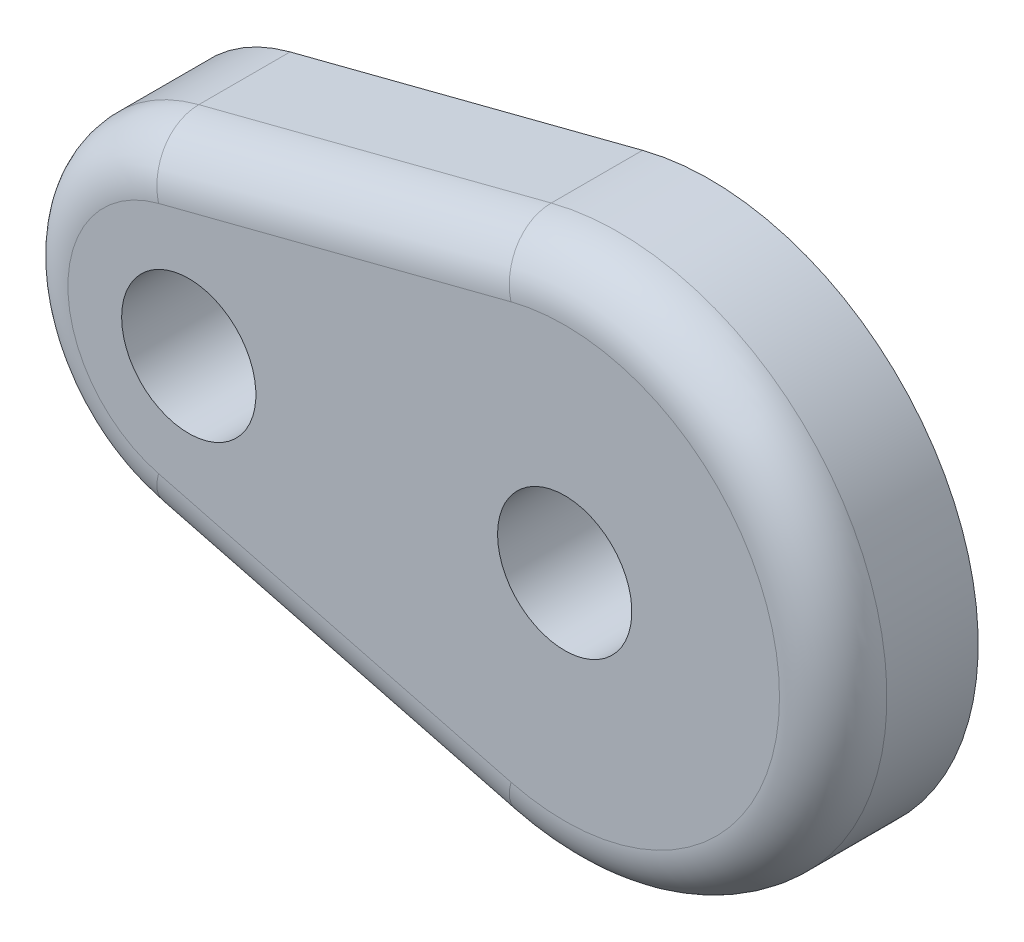
ISO-10303-21;
HEADER;
FILE_DESCRIPTION(('STEP AP214'),'2;1');
FILE_NAME('part.step','',(''),(''),'','','');
FILE_SCHEMA(('AUTOMOTIVE_DESIGN { 1 0 10303 214 1 1 1 1 }'));
ENDSEC;
DATA;
#1=APPLICATION_CONTEXT('core data for automotive mechanical design processes');
#2=APPLICATION_PROTOCOL_DEFINITION('international standard','automotive_design',2000,#1);
#3=PRODUCT_CONTEXT('',#1,'mechanical');
#4=PRODUCT('Part','Part','',(#3));
#5=PRODUCT_RELATED_PRODUCT_CATEGORY('part','',(#4));
#6=PRODUCT_DEFINITION_FORMATION('','',#4);
#7=PRODUCT_DEFINITION_CONTEXT('part definition',#1,'design');
#8=PRODUCT_DEFINITION('design','',#6,#7);
#9=PRODUCT_DEFINITION_SHAPE('','',#8);
#10=(LENGTH_UNIT() NAMED_UNIT(*) SI_UNIT(.MILLI.,.METRE.));
#11=(NAMED_UNIT(*) PLANE_ANGLE_UNIT() SI_UNIT($,.RADIAN.));
#12=(NAMED_UNIT(*) SI_UNIT($,.STERADIAN.) SOLID_ANGLE_UNIT());
#13=UNCERTAINTY_MEASURE_WITH_UNIT(LENGTH_MEASURE(1.E-05),#10,'distance_accuracy_value','');
#14=(GEOMETRIC_REPRESENTATION_CONTEXT(3) GLOBAL_UNCERTAINTY_ASSIGNED_CONTEXT((#13)) GLOBAL_UNIT_ASSIGNED_CONTEXT((#10,
#11,#12)) REPRESENTATION_CONTEXT('',''));
#15=CARTESIAN_POINT('',(0.,0.,0.));
#16=DIRECTION('',(0.,0.,1.));
#17=DIRECTION('',(1.,0.,0.));
#18=AXIS2_PLACEMENT_3D('',#15,#16,#17);
#19=CARTESIAN_POINT('',(-8.89,0.,4.7625));
#20=DIRECTION('',(0.,0.,-1.));
#21=DIRECTION('',(-1.,0.,0.));
#22=AXIS2_PLACEMENT_3D('',#19,#20,#21);
#23=CYLINDRICAL_SURFACE('',#22,4.1275);
#24=DIRECTION('',(0.,0.,-1.));
#25=VECTOR('',#24,1.);
#26=CARTESIAN_POINT('',(-9.921875,-3.99643469036778,4.7625));
#27=LINE('',#26,#25);
#28=CARTESIAN_POINT('',(-9.921875,-3.99643469036778,3.4925));
#29=VERTEX_POINT('',#28);
#30=CARTESIAN_POINT('',(-9.921875,-3.99643469036778,1.3335));
#31=VERTEX_POINT('',#30);
#32=EDGE_CURVE('E114',#29,#31,#27,.T.);
#33=ORIENTED_EDGE('',*,*,#32,.F.);
#34=CARTESIAN_POINT('',(-8.89,0.,3.4925));
#35=DIRECTION('',(0.,0.,1.));
#36=DIRECTION('',(1.,0.,0.));
#37=AXIS2_PLACEMENT_3D('',#34,#35,#36);
#38=CIRCLE('',#37,4.1275);
#39=CARTESIAN_POINT('',(-9.921875,3.99643469036778,3.4925));
#40=VERTEX_POINT('',#39);
#41=EDGE_CURVE('E125',#29,#40,#38,.F.);
#42=ORIENTED_EDGE('',*,*,#41,.T.);
#43=DIRECTION('',(0.,0.,-1.));
#44=VECTOR('',#43,1.);
#45=CARTESIAN_POINT('',(-9.921875,3.99643469036778,4.7625));
#46=LINE('',#45,#44);
#47=CARTESIAN_POINT('',(-9.921875,3.99643469036778,1.3335));
#48=VERTEX_POINT('',#47);
#49=EDGE_CURVE('E89',#40,#48,#46,.T.);
#50=ORIENTED_EDGE('',*,*,#49,.T.);
#51=CARTESIAN_POINT('',(-8.89,0.,1.3335));
#52=DIRECTION('',(0.,0.,-1.));
#53=DIRECTION('',(-1.,0.,0.));
#54=AXIS2_PLACEMENT_3D('',#51,#52,#53);
#55=CIRCLE('',#54,4.1275);
#56=EDGE_CURVE('E99',#48,#31,#55,.F.);
#57=ORIENTED_EDGE('',*,*,#56,.T.);
#58=EDGE_LOOP('',(#33,#42,#50,#57));
#59=FACE_BOUND('',#58,.T.);
#60=ADVANCED_FACE('F32',(#59),#23,.T.);
#61=CARTESIAN_POINT('',(-9.921875,-3.99643469036778,4.7625));
#62=DIRECTION('',(0.25,0.968245836551854,0.));
#63=DIRECTION('',(-0.968245836551854,0.25,0.));
#64=AXIS2_PLACEMENT_3D('',#61,#62,#63);
#65=PLANE('',#64);
#66=DIRECTION('',(0.,0.,-1.));
#67=VECTOR('',#66,1.);
#68=CARTESIAN_POINT('',(-1.5875,-6.14836106210428,4.7625));
#69=LINE('',#68,#67);
#70=CARTESIAN_POINT('',(-1.5875,-6.14836106210428,3.4925));
#71=VERTEX_POINT('',#70);
#72=CARTESIAN_POINT('',(-1.5875,-6.14836106210428,1.3335));
#73=VERTEX_POINT('',#72);
#74=EDGE_CURVE('E88',#71,#73,#69,.T.);
#75=ORIENTED_EDGE('',*,*,#74,.F.);
#76=DIRECTION('',(0.968245836551854,-0.25,0.));
#77=VECTOR('',#76,1.);
#78=CARTESIAN_POINT('',(-9.921875,-3.99643469036778,3.4925));
#79=LINE('',#78,#77);
#80=EDGE_CURVE('E128',#71,#29,#79,.F.);
#81=ORIENTED_EDGE('',*,*,#80,.T.);
#82=ORIENTED_EDGE('',*,*,#32,.T.);
#83=DIRECTION('',(0.968245836551854,-0.25,0.));
#84=VECTOR('',#83,1.);
#85=CARTESIAN_POINT('',(-1.5875,-6.14836106210428,1.3335));
#86=LINE('',#85,#84);
#87=EDGE_CURVE('E102',#31,#73,#86,.T.);
#88=ORIENTED_EDGE('',*,*,#87,.T.);
#89=EDGE_LOOP('',(#75,#81,#82,#88));
#90=FACE_BOUND('',#89,.T.);
#91=ADVANCED_FACE('F171',(#90),#65,.F.);
#92=CARTESIAN_POINT('',(0.,0.,4.7625));
#93=DIRECTION('',(0.,0.,-1.));
#94=DIRECTION('',(-1.,0.,0.));
#95=AXIS2_PLACEMENT_3D('',#92,#93,#94);
#96=CYLINDRICAL_SURFACE('',#95,6.35);
#97=DIRECTION('',(0.,0.,-1.));
#98=VECTOR('',#97,1.);
#99=CARTESIAN_POINT('',(-1.5875,6.14836106210428,4.7625));
#100=LINE('',#99,#98);
#101=CARTESIAN_POINT('',(-1.5875,6.14836106210428,3.4925));
#102=VERTEX_POINT('',#101);
#103=CARTESIAN_POINT('',(-1.5875,6.14836106210428,1.3335));
#104=VERTEX_POINT('',#103);
#105=EDGE_CURVE('E83',#102,#104,#100,.T.);
#106=ORIENTED_EDGE('',*,*,#105,.F.);
#107=CARTESIAN_POINT('',(0.,0.,3.4925));
#108=DIRECTION('',(0.,0.,1.));
#109=DIRECTION('',(1.,0.,0.));
#110=AXIS2_PLACEMENT_3D('',#107,#108,#109);
#111=CIRCLE('',#110,6.35);
#112=EDGE_CURVE('E41',#102,#71,#111,.F.);
#113=ORIENTED_EDGE('',*,*,#112,.T.);
#114=ORIENTED_EDGE('',*,*,#74,.T.);
#115=CARTESIAN_POINT('',(0.,0.,1.3335));
#116=DIRECTION('',(0.,0.,-1.));
#117=DIRECTION('',(-1.,0.,0.));
#118=AXIS2_PLACEMENT_3D('',#115,#116,#117);
#119=CIRCLE('',#118,6.35);
#120=EDGE_CURVE('E96',#73,#104,#119,.F.);
#121=ORIENTED_EDGE('',*,*,#120,.T.);
#122=EDGE_LOOP('',(#106,#113,#114,#121));
#123=FACE_BOUND('',#122,.T.);
#124=ADVANCED_FACE('F101',(#123),#96,.T.);
#125=CARTESIAN_POINT('',(-9.921875,3.99643469036778,4.7625));
#126=DIRECTION('',(-0.25,0.968245836551854,0.));
#127=DIRECTION('',(-0.968245836551854,-0.25,0.));
#128=AXIS2_PLACEMENT_3D('',#125,#126,#127);
#129=PLANE('',#128);
#130=ORIENTED_EDGE('',*,*,#49,.F.);
#131=DIRECTION('',(0.968245836551854,0.25,0.));
#132=VECTOR('',#131,1.);
#133=CARTESIAN_POINT('',(-9.921875,3.99643469036778,3.4925));
#134=LINE('',#133,#132);
#135=EDGE_CURVE('E11',#40,#102,#134,.T.);
#136=ORIENTED_EDGE('',*,*,#135,.T.);
#137=ORIENTED_EDGE('',*,*,#105,.T.);
#138=DIRECTION('',(-0.968245836551854,-0.25,0.));
#139=VECTOR('',#138,1.);
#140=CARTESIAN_POINT('',(-9.921875,3.99643469036778,1.3335));
#141=LINE('',#140,#139);
#142=EDGE_CURVE('E86',#104,#48,#141,.T.);
#143=ORIENTED_EDGE('',*,*,#142,.T.);
#144=EDGE_LOOP('',(#130,#136,#137,#143));
#145=FACE_BOUND('',#144,.T.);
#146=ADVANCED_FACE('F85',(#145),#129,.T.);
#147=CARTESIAN_POINT('',(-8.89,0.,4.7625));
#148=DIRECTION('',(0.,0.,1.));
#149=DIRECTION('',(1.,0.,0.));
#150=AXIS2_PLACEMENT_3D('',#147,#148,#149);
#151=PLANE('',#150);
#152=DIRECTION('',(0.968245836551854,0.25,0.));
#153=VECTOR('',#152,1.);
#154=CARTESIAN_POINT('',(-9.604375,2.76676247794693,4.7625));
#155=LINE('',#154,#153);
#156=CARTESIAN_POINT('',(-1.27,4.91868884968342,4.7625));
#157=VERTEX_POINT('',#156);
#158=CARTESIAN_POINT('',(-9.604375,2.76676247794693,4.7625));
#159=VERTEX_POINT('',#158);
#160=EDGE_CURVE('E116',#157,#159,#155,.F.);
#161=ORIENTED_EDGE('',*,*,#160,.T.);
#162=CARTESIAN_POINT('',(-8.89,0.,4.7625));
#163=DIRECTION('',(0.,0.,1.));
#164=DIRECTION('',(1.,0.,0.));
#165=AXIS2_PLACEMENT_3D('',#162,#163,#164);
#166=CIRCLE('',#165,2.8575);
#167=CARTESIAN_POINT('',(-9.604375,-2.76676247794693,4.7625));
#168=VERTEX_POINT('',#167);
#169=EDGE_CURVE('E122',#159,#168,#166,.T.);
#170=ORIENTED_EDGE('',*,*,#169,.T.);
#171=DIRECTION('',(0.968245836551854,-0.25,0.));
#172=VECTOR('',#171,1.);
#173=CARTESIAN_POINT('',(-1.27,-4.91868884968342,4.7625));
#174=LINE('',#173,#172);
#175=CARTESIAN_POINT('',(-1.27,-4.91868884968342,4.7625));
#176=VERTEX_POINT('',#175);
#177=EDGE_CURVE('E120',#168,#176,#174,.T.);
#178=ORIENTED_EDGE('',*,*,#177,.T.);
#179=CARTESIAN_POINT('',(0.,0.,4.7625));
#180=DIRECTION('',(0.,0.,1.));
#181=DIRECTION('',(1.,0.,0.));
#182=AXIS2_PLACEMENT_3D('',#179,#180,#181);
#183=CIRCLE('',#182,5.08);
#184=EDGE_CURVE('E118',#176,#157,#183,.T.);
#185=ORIENTED_EDGE('',*,*,#184,.T.);
#186=EDGE_LOOP('',(#161,#170,#178,#185));
#187=FACE_BOUND('',#186,.T.);
#188=CARTESIAN_POINT('',(-8.89,0.,4.7625));
#189=DIRECTION('',(0.,0.,-1.));
#190=DIRECTION('',(-1.,0.,0.));
#191=AXIS2_PLACEMENT_3D('',#188,#189,#190);
#192=CIRCLE('',#191,1.5875);
#193=CARTESIAN_POINT('',(-10.4775,0.,4.7625));
#194=VERTEX_POINT('',#193);
#195=EDGE_CURVE('E146',#194,#194,#192,.T.);
#196=ORIENTED_EDGE('',*,*,#195,.T.);
#197=EDGE_LOOP('',(#196));
#198=FACE_BOUND('',#197,.T.);
#199=CARTESIAN_POINT('',(0.,0.,4.7625));
#200=DIRECTION('',(0.,0.,-1.));
#201=DIRECTION('',(-1.,0.,0.));
#202=AXIS2_PLACEMENT_3D('',#199,#200,#201);
#203=CIRCLE('',#202,1.5875);
#204=CARTESIAN_POINT('',(-1.5875,0.,4.7625));
#205=VERTEX_POINT('',#204);
#206=EDGE_CURVE('E103',#205,#205,#203,.T.);
#207=ORIENTED_EDGE('',*,*,#206,.T.);
#208=EDGE_LOOP('',(#207));
#209=FACE_BOUND('',#208,.T.);
#210=ADVANCED_FACE('F158',(#187,#198,#209),#151,.T.);
#211=CARTESIAN_POINT('',(0.,4.206875,1.3335));
#212=DIRECTION('',(0.,0.,-1.));
#213=DIRECTION('',(-1.,0.,0.));
#214=AXIS2_PLACEMENT_3D('',#211,#212,#213);
#215=PLANE('',#214);
#216=CARTESIAN_POINT('',(-8.89,0.,1.3335));
#217=DIRECTION('',(0.,0.,-1.));
#218=DIRECTION('',(-1.,0.,0.));
#219=AXIS2_PLACEMENT_3D('',#216,#217,#218);
#220=CIRCLE('',#219,1.58749999999999);
#221=CARTESIAN_POINT('',(-10.4775,0.,1.3335));
#222=VERTEX_POINT('',#221);
#223=EDGE_CURVE('E141',#222,#222,#220,.T.);
#224=ORIENTED_EDGE('',*,*,#223,.F.);
#225=EDGE_LOOP('',(#224));
#226=FACE_BOUND('',#225,.T.);
#227=CARTESIAN_POINT('',(0.,0.,1.3335));
#228=DIRECTION('',(0.,0.,-1.));
#229=DIRECTION('',(-1.,0.,0.));
#230=AXIS2_PLACEMENT_3D('',#227,#228,#229);
#231=CIRCLE('',#230,1.58749999999999);
#232=CARTESIAN_POINT('',(-1.58749999999999,0.,1.3335));
#233=VERTEX_POINT('',#232);
#234=EDGE_CURVE('E107',#233,#233,#231,.T.);
#235=ORIENTED_EDGE('',*,*,#234,.F.);
#236=EDGE_LOOP('',(#235));
#237=FACE_BOUND('',#236,.T.);
#238=ORIENTED_EDGE('',*,*,#56,.F.);
#239=ORIENTED_EDGE('',*,*,#142,.F.);
#240=ORIENTED_EDGE('',*,*,#120,.F.);
#241=ORIENTED_EDGE('',*,*,#87,.F.);
#242=EDGE_LOOP('',(#238,#239,#240,#241));
#243=FACE_BOUND('',#242,.T.);
#244=ADVANCED_FACE('F94',(#226,#237,#243),#215,.T.);
#245=CARTESIAN_POINT('',(0.,0.,1.3335));
#246=DIRECTION('',(0.,0.,-1.));
#247=DIRECTION('',(-1.,0.,0.));
#248=AXIS2_PLACEMENT_3D('',#245,#246,#247);
#249=CYLINDRICAL_SURFACE('',#248,1.58749999999999);
#250=ORIENTED_EDGE('',*,*,#206,.F.);
#251=EDGE_LOOP('',(#250));
#252=FACE_BOUND('',#251,.T.);
#253=ORIENTED_EDGE('',*,*,#234,.T.);
#254=EDGE_LOOP('',(#253));
#255=FACE_BOUND('',#254,.T.);
#256=ADVANCED_FACE('F155',(#252,#255),#249,.F.);
#257=CARTESIAN_POINT('',(-8.89,0.,1.3335));
#258=DIRECTION('',(0.,0.,-1.));
#259=DIRECTION('',(-1.,0.,0.));
#260=AXIS2_PLACEMENT_3D('',#257,#258,#259);
#261=CYLINDRICAL_SURFACE('',#260,1.58749999999999);
#262=ORIENTED_EDGE('',*,*,#195,.F.);
#263=EDGE_LOOP('',(#262));
#264=FACE_BOUND('',#263,.T.);
#265=ORIENTED_EDGE('',*,*,#223,.T.);
#266=EDGE_LOOP('',(#265));
#267=FACE_BOUND('',#266,.T.);
#268=ADVANCED_FACE('F165',(#264,#267),#261,.F.);
#269=CARTESIAN_POINT('',(0.,0.,3.4925));
#270=DIRECTION('',(0.,0.,1.));
#271=DIRECTION('',(1.,0.,0.));
#272=AXIS2_PLACEMENT_3D('',#269,#270,#271);
#273=TOROIDAL_SURFACE('',#272,5.08,1.27);
#274=CARTESIAN_POINT('',(-1.27,-4.91868884968342,3.4925));
#275=DIRECTION('',(-0.968245836551854,0.25,0.));
#276=DIRECTION('',(-0.25,-0.968245836551854,0.));
#277=AXIS2_PLACEMENT_3D('',#274,#275,#276);
#278=CIRCLE('',#277,1.27);
#279=EDGE_CURVE('E134',#71,#176,#278,.T.);
#280=ORIENTED_EDGE('',*,*,#279,.F.);
#281=ORIENTED_EDGE('',*,*,#112,.F.);
#282=CARTESIAN_POINT('',(-1.27,4.91868884968342,3.4925));
#283=DIRECTION('',(-0.968245836551854,-0.25,0.));
#284=DIRECTION('',(0.25,-0.968245836551854,0.));
#285=AXIS2_PLACEMENT_3D('',#282,#283,#284);
#286=CIRCLE('',#285,1.27);
#287=EDGE_CURVE('E36',#157,#102,#286,.T.);
#288=ORIENTED_EDGE('',*,*,#287,.F.);
#289=ORIENTED_EDGE('',*,*,#184,.F.);
#290=EDGE_LOOP('',(#280,#281,#288,#289));
#291=FACE_BOUND('',#290,.T.);
#292=ADVANCED_FACE('F34',(#291),#273,.T.);
#293=CARTESIAN_POINT('',(-9.604375,2.76676247794693,3.4925));
#294=DIRECTION('',(0.968245836551854,0.25,0.));
#295=DIRECTION('',(-0.25,0.968245836551854,0.));
#296=AXIS2_PLACEMENT_3D('',#293,#294,#295);
#297=CYLINDRICAL_SURFACE('',#296,1.27);
#298=ORIENTED_EDGE('',*,*,#287,.T.);
#299=ORIENTED_EDGE('',*,*,#135,.F.);
#300=CARTESIAN_POINT('',(-9.604375,2.76676247794693,3.4925));
#301=DIRECTION('',(-0.968245836551854,-0.25,0.));
#302=DIRECTION('',(0.25,-0.968245836551854,0.));
#303=AXIS2_PLACEMENT_3D('',#300,#301,#302);
#304=CIRCLE('',#303,1.27);
#305=EDGE_CURVE('E133',#159,#40,#304,.T.);
#306=ORIENTED_EDGE('',*,*,#305,.F.);
#307=ORIENTED_EDGE('',*,*,#160,.F.);
#308=EDGE_LOOP('',(#298,#299,#306,#307));
#309=FACE_BOUND('',#308,.T.);
#310=ADVANCED_FACE('F188',(#309),#297,.T.);
#311=CARTESIAN_POINT('',(-9.604375,-2.76676247794693,3.4925));
#312=DIRECTION('',(-0.968245836551854,0.25,0.));
#313=DIRECTION('',(-0.25,-0.968245836551854,0.));
#314=AXIS2_PLACEMENT_3D('',#311,#312,#313);
#315=CYLINDRICAL_SURFACE('',#314,1.27);
#316=ORIENTED_EDGE('',*,*,#279,.T.);
#317=ORIENTED_EDGE('',*,*,#177,.F.);
#318=CARTESIAN_POINT('',(-9.604375,-2.76676247794693,3.4925));
#319=DIRECTION('',(-0.968245836551854,0.25,0.));
#320=DIRECTION('',(-0.25,-0.968245836551854,0.));
#321=AXIS2_PLACEMENT_3D('',#318,#319,#320);
#322=CIRCLE('',#321,1.27);
#323=EDGE_CURVE('E131',#29,#168,#322,.T.);
#324=ORIENTED_EDGE('',*,*,#323,.F.);
#325=ORIENTED_EDGE('',*,*,#80,.F.);
#326=EDGE_LOOP('',(#316,#317,#324,#325));
#327=FACE_BOUND('',#326,.T.);
#328=ADVANCED_FACE('F185',(#327),#315,.T.);
#329=CARTESIAN_POINT('',(-8.89,0.,3.4925));
#330=DIRECTION('',(0.,0.,1.));
#331=DIRECTION('',(1.,0.,0.));
#332=AXIS2_PLACEMENT_3D('',#329,#330,#331);
#333=TOROIDAL_SURFACE('',#332,2.8575,1.27);
#334=ORIENTED_EDGE('',*,*,#305,.T.);
#335=ORIENTED_EDGE('',*,*,#41,.F.);
#336=ORIENTED_EDGE('',*,*,#323,.T.);
#337=ORIENTED_EDGE('',*,*,#169,.F.);
#338=EDGE_LOOP('',(#334,#335,#336,#337));
#339=FACE_BOUND('',#338,.T.);
#340=ADVANCED_FACE('F182',(#339),#333,.T.);
#341=CLOSED_SHELL('',(#60,#91,#124,#146,#210,#244,#256,#268,#292,#310,#328,#340));
#342=MANIFOLD_SOLID_BREP('B2',#341);
#343=ADVANCED_BREP_SHAPE_REPRESENTATION('',(#18,#342),#14);
#344=SHAPE_DEFINITION_REPRESENTATION(#9,#343);
ENDSEC;
END-ISO-10303-21;
